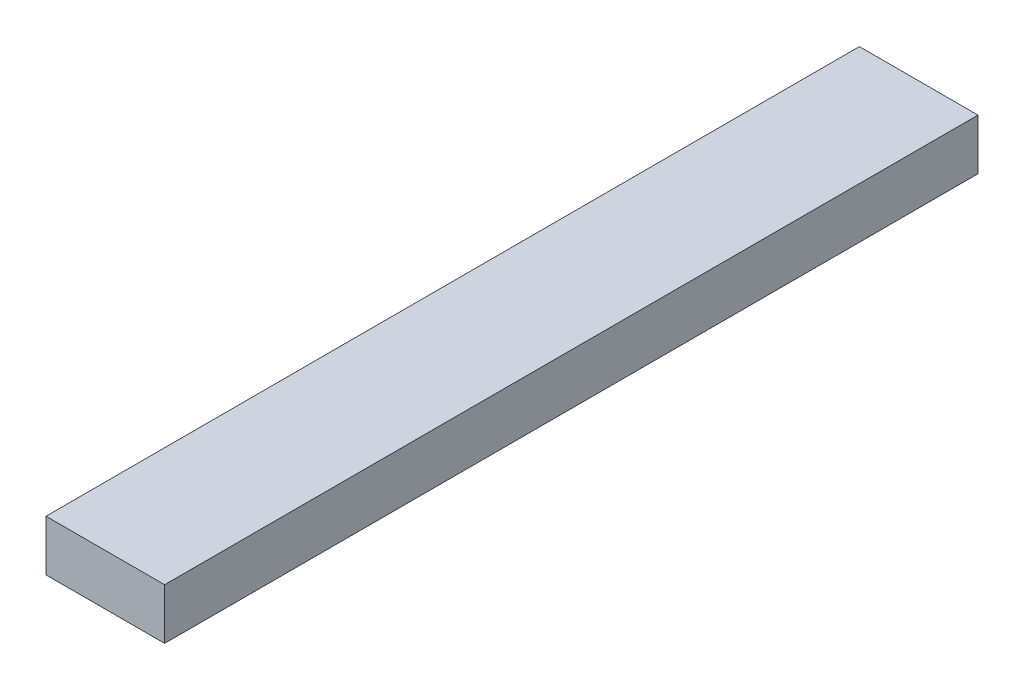
ISO-10303-21;
HEADER;
FILE_DESCRIPTION(('STEP AP214'),'2;1');
FILE_NAME('part.step','',(''),(''),'','','');
FILE_SCHEMA(('AUTOMOTIVE_DESIGN { 1 0 10303 214 1 1 1 1 }'));
ENDSEC;
DATA;
#1=APPLICATION_CONTEXT('core data for automotive mechanical design processes');
#2=APPLICATION_PROTOCOL_DEFINITION('international standard','automotive_design',2000,#1);
#3=PRODUCT_CONTEXT('',#1,'mechanical');
#4=PRODUCT('Part','Part','',(#3));
#5=PRODUCT_RELATED_PRODUCT_CATEGORY('part','',(#4));
#6=PRODUCT_DEFINITION_FORMATION('','',#4);
#7=PRODUCT_DEFINITION_CONTEXT('part definition',#1,'design');
#8=PRODUCT_DEFINITION('design','',#6,#7);
#9=PRODUCT_DEFINITION_SHAPE('','',#8);
#10=(LENGTH_UNIT() NAMED_UNIT(*) SI_UNIT(.MILLI.,.METRE.));
#11=(NAMED_UNIT(*) PLANE_ANGLE_UNIT() SI_UNIT($,.RADIAN.));
#12=(NAMED_UNIT(*) SI_UNIT($,.STERADIAN.) SOLID_ANGLE_UNIT());
#13=UNCERTAINTY_MEASURE_WITH_UNIT(LENGTH_MEASURE(1.E-05),#10,'distance_accuracy_value','');
#14=(GEOMETRIC_REPRESENTATION_CONTEXT(3) GLOBAL_UNCERTAINTY_ASSIGNED_CONTEXT((#13)) GLOBAL_UNIT_ASSIGNED_CONTEXT((#10,
#11,#12)) REPRESENTATION_CONTEXT('',''));
#15=CARTESIAN_POINT('',(0.,0.,0.));
#16=DIRECTION('',(0.,0.,1.));
#17=DIRECTION('',(1.,0.,0.));
#18=AXIS2_PLACEMENT_3D('',#15,#16,#17);
#19=CARTESIAN_POINT('',(-88.9,73.5774941995359,609.6));
#20=DIRECTION('',(1.,0.,0.));
#21=DIRECTION('',(0.,1.,0.));
#22=AXIS2_PLACEMENT_3D('',#19,#20,#21);
#23=PLANE('',#22);
#24=DIRECTION('',(0.,-1.,0.));
#25=VECTOR('',#24,1.);
#26=CARTESIAN_POINT('',(-88.9,73.5774941995359,0.));
#27=LINE('',#26,#25);
#28=CARTESIAN_POINT('',(-88.9,73.5774941995359,0.));
#29=VERTEX_POINT('',#28);
#30=CARTESIAN_POINT('',(-88.9,35.4774941995359,0.));
#31=VERTEX_POINT('',#30);
#32=EDGE_CURVE('E95',#29,#31,#27,.T.);
#33=ORIENTED_EDGE('',*,*,#32,.T.);
#34=DIRECTION('',(0.,0.,-1.));
#35=VECTOR('',#34,1.);
#36=CARTESIAN_POINT('',(-88.9,35.4774941995359,609.6));
#37=LINE('',#36,#35);
#38=CARTESIAN_POINT('',(-88.9,35.4774941995359,609.6));
#39=VERTEX_POINT('',#38);
#40=EDGE_CURVE('E11',#39,#31,#37,.T.);
#41=ORIENTED_EDGE('',*,*,#40,.F.);
#42=DIRECTION('',(0.,-1.,0.));
#43=VECTOR('',#42,1.);
#44=CARTESIAN_POINT('',(-88.9,73.5774941995359,609.6));
#45=LINE('',#44,#43);
#46=CARTESIAN_POINT('',(-88.9,73.5774941995359,609.6));
#47=VERTEX_POINT('',#46);
#48=EDGE_CURVE('E83',#47,#39,#45,.T.);
#49=ORIENTED_EDGE('',*,*,#48,.F.);
#50=DIRECTION('',(0.,0.,-1.));
#51=VECTOR('',#50,1.);
#52=CARTESIAN_POINT('',(-88.9,73.5774941995359,609.6));
#53=LINE('',#52,#51);
#54=EDGE_CURVE('E91',#47,#29,#53,.T.);
#55=ORIENTED_EDGE('',*,*,#54,.T.);
#56=EDGE_LOOP('',(#33,#41,#49,#55));
#57=FACE_BOUND('',#56,.T.);
#58=ADVANCED_FACE('F32',(#57),#23,.F.);
#59=CARTESIAN_POINT('',(-88.9,35.4774941995359,609.6));
#60=DIRECTION('',(0.,1.,0.));
#61=DIRECTION('',(0.,0.,1.));
#62=AXIS2_PLACEMENT_3D('',#59,#60,#61);
#63=PLANE('',#62);
#64=DIRECTION('',(1.,0.,0.));
#65=VECTOR('',#64,1.);
#66=CARTESIAN_POINT('',(-88.9,35.4774941995359,0.));
#67=LINE('',#66,#65);
#68=CARTESIAN_POINT('',(0.,35.4774941995359,0.));
#69=VERTEX_POINT('',#68);
#70=EDGE_CURVE('E87',#31,#69,#67,.T.);
#71=ORIENTED_EDGE('',*,*,#70,.T.);
#72=DIRECTION('',(0.,0.,-1.));
#73=VECTOR('',#72,1.);
#74=CARTESIAN_POINT('',(0.,35.4774941995359,609.6));
#75=LINE('',#74,#73);
#76=CARTESIAN_POINT('',(0.,35.4774941995359,609.6));
#77=VERTEX_POINT('',#76);
#78=EDGE_CURVE('E40',#77,#69,#75,.T.);
#79=ORIENTED_EDGE('',*,*,#78,.F.);
#80=DIRECTION('',(1.,0.,0.));
#81=VECTOR('',#80,1.);
#82=CARTESIAN_POINT('',(-88.9,35.4774941995359,609.6));
#83=LINE('',#82,#81);
#84=EDGE_CURVE('E78',#39,#77,#83,.T.);
#85=ORIENTED_EDGE('',*,*,#84,.F.);
#86=ORIENTED_EDGE('',*,*,#40,.T.);
#87=EDGE_LOOP('',(#71,#79,#85,#86));
#88=FACE_BOUND('',#87,.T.);
#89=ADVANCED_FACE('F86',(#88),#63,.F.);
#90=CARTESIAN_POINT('',(0.,73.5774941995359,609.6));
#91=DIRECTION('',(-1.,0.,0.));
#92=DIRECTION('',(0.,-1.,0.));
#93=AXIS2_PLACEMENT_3D('',#90,#91,#92);
#94=PLANE('',#93);
#95=DIRECTION('',(0.,1.,0.));
#96=VECTOR('',#95,1.);
#97=CARTESIAN_POINT('',(0.,73.5774941995359,0.));
#98=LINE('',#97,#96);
#99=CARTESIAN_POINT('',(0.,73.5774941995359,0.));
#100=VERTEX_POINT('',#99);
#101=EDGE_CURVE('E65',#69,#100,#98,.T.);
#102=ORIENTED_EDGE('',*,*,#101,.T.);
#103=DIRECTION('',(0.,0.,-1.));
#104=VECTOR('',#103,1.);
#105=CARTESIAN_POINT('',(0.,73.5774941995359,609.6));
#106=LINE('',#105,#104);
#107=CARTESIAN_POINT('',(0.,73.5774941995359,609.6));
#108=VERTEX_POINT('',#107);
#109=EDGE_CURVE('E88',#108,#100,#106,.T.);
#110=ORIENTED_EDGE('',*,*,#109,.F.);
#111=DIRECTION('',(0.,1.,0.));
#112=VECTOR('',#111,1.);
#113=CARTESIAN_POINT('',(0.,73.5774941995359,609.6));
#114=LINE('',#113,#112);
#115=EDGE_CURVE('E81',#77,#108,#114,.T.);
#116=ORIENTED_EDGE('',*,*,#115,.F.);
#117=ORIENTED_EDGE('',*,*,#78,.T.);
#118=EDGE_LOOP('',(#102,#110,#116,#117));
#119=FACE_BOUND('',#118,.T.);
#120=ADVANCED_FACE('F89',(#119),#94,.F.);
#121=CARTESIAN_POINT('',(-88.9,73.5774941995359,609.6));
#122=DIRECTION('',(0.,-1.,0.));
#123=DIRECTION('',(0.,0.,-1.));
#124=AXIS2_PLACEMENT_3D('',#121,#122,#123);
#125=PLANE('',#124);
#126=DIRECTION('',(-1.,0.,0.));
#127=VECTOR('',#126,1.);
#128=CARTESIAN_POINT('',(-88.9,73.5774941995359,0.));
#129=LINE('',#128,#127);
#130=EDGE_CURVE('E71',#100,#29,#129,.T.);
#131=ORIENTED_EDGE('',*,*,#130,.T.);
#132=ORIENTED_EDGE('',*,*,#54,.F.);
#133=DIRECTION('',(-1.,0.,0.));
#134=VECTOR('',#133,1.);
#135=CARTESIAN_POINT('',(-88.9,73.5774941995359,609.6));
#136=LINE('',#135,#134);
#137=EDGE_CURVE('E48',#108,#47,#136,.T.);
#138=ORIENTED_EDGE('',*,*,#137,.F.);
#139=ORIENTED_EDGE('',*,*,#109,.T.);
#140=EDGE_LOOP('',(#131,#132,#138,#139));
#141=FACE_BOUND('',#140,.T.);
#142=ADVANCED_FACE('F102',(#141),#125,.F.);
#143=CARTESIAN_POINT('',(0.,0.,609.6));
#144=DIRECTION('',(0.,0.,1.));
#145=DIRECTION('',(1.,0.,0.));
#146=AXIS2_PLACEMENT_3D('',#143,#144,#145);
#147=PLANE('',#146);
#148=ORIENTED_EDGE('',*,*,#48,.T.);
#149=ORIENTED_EDGE('',*,*,#84,.T.);
#150=ORIENTED_EDGE('',*,*,#115,.T.);
#151=ORIENTED_EDGE('',*,*,#137,.T.);
#152=EDGE_LOOP('',(#148,#149,#150,#151));
#153=FACE_BOUND('',#152,.T.);
#154=ADVANCED_FACE('F79',(#153),#147,.T.);
#155=CARTESIAN_POINT('',(0.,0.,0.));
#156=DIRECTION('',(0.,0.,1.));
#157=DIRECTION('',(1.,0.,0.));
#158=AXIS2_PLACEMENT_3D('',#155,#156,#157);
#159=PLANE('',#158);
#160=ORIENTED_EDGE('',*,*,#32,.F.);
#161=ORIENTED_EDGE('',*,*,#130,.F.);
#162=ORIENTED_EDGE('',*,*,#101,.F.);
#163=ORIENTED_EDGE('',*,*,#70,.F.);
#164=EDGE_LOOP('',(#160,#161,#162,#163));
#165=FACE_BOUND('',#164,.T.);
#166=ADVANCED_FACE('F105',(#165),#159,.F.);
#167=CLOSED_SHELL('',(#58,#89,#120,#142,#154,#166));
#168=MANIFOLD_SOLID_BREP('B2',#167);
#169=ADVANCED_BREP_SHAPE_REPRESENTATION('',(#18,#168),#14);
#170=SHAPE_DEFINITION_REPRESENTATION(#9,#169);
ENDSEC;
END-ISO-10303-21;
